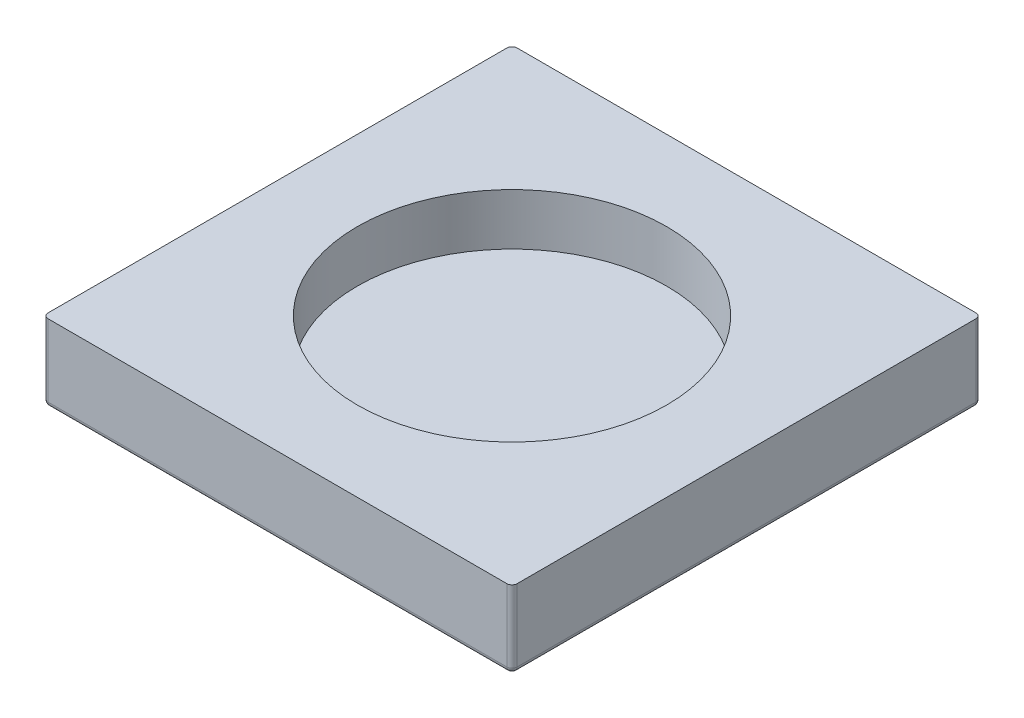
ISO-10303-21;
HEADER;
FILE_DESCRIPTION(('STEP AP214'),'2;1');
FILE_NAME('part.step','',(''),(''),'','','');
FILE_SCHEMA(('AUTOMOTIVE_DESIGN { 1 0 10303 214 1 1 1 1 }'));
ENDSEC;
DATA;
#1=APPLICATION_CONTEXT('core data for automotive mechanical design processes');
#2=APPLICATION_PROTOCOL_DEFINITION('international standard','automotive_design',2000,#1);
#3=PRODUCT_CONTEXT('',#1,'mechanical');
#4=PRODUCT('Part','Part','',(#3));
#5=PRODUCT_RELATED_PRODUCT_CATEGORY('part','',(#4));
#6=PRODUCT_DEFINITION_FORMATION('','',#4);
#7=PRODUCT_DEFINITION_CONTEXT('part definition',#1,'design');
#8=PRODUCT_DEFINITION('design','',#6,#7);
#9=PRODUCT_DEFINITION_SHAPE('','',#8);
#10=(LENGTH_UNIT() NAMED_UNIT(*) SI_UNIT(.MILLI.,.METRE.));
#11=(NAMED_UNIT(*) PLANE_ANGLE_UNIT() SI_UNIT($,.RADIAN.));
#12=(NAMED_UNIT(*) SI_UNIT($,.STERADIAN.) SOLID_ANGLE_UNIT());
#13=UNCERTAINTY_MEASURE_WITH_UNIT(LENGTH_MEASURE(1.E-05),#10,'distance_accuracy_value','');
#14=(GEOMETRIC_REPRESENTATION_CONTEXT(3) GLOBAL_UNCERTAINTY_ASSIGNED_CONTEXT((#13)) GLOBAL_UNIT_ASSIGNED_CONTEXT((#10,
#11,#12)) REPRESENTATION_CONTEXT('',''));
#15=CARTESIAN_POINT('',(0.,0.,0.));
#16=DIRECTION('',(0.,0.,1.));
#17=DIRECTION('',(1.,0.,0.));
#18=AXIS2_PLACEMENT_3D('',#15,#16,#17);
#19=CARTESIAN_POINT('',(22.75,7.5,22.75));
#20=DIRECTION('',(-1.,0.,0.));
#21=DIRECTION('',(0.,0.,1.));
#22=AXIS2_PLACEMENT_3D('',#19,#20,#21);
#23=PLANE('',#22);
#24=DIRECTION('',(0.,0.,-1.));
#25=VECTOR('',#24,1.);
#26=CARTESIAN_POINT('',(22.75,0.5,-22.75));
#27=LINE('',#26,#25);
#28=CARTESIAN_POINT('',(22.75,0.5,22.25));
#29=VERTEX_POINT('',#28);
#30=CARTESIAN_POINT('',(22.75,0.5,-22.25));
#31=VERTEX_POINT('',#30);
#32=EDGE_CURVE('E155',#29,#31,#27,.T.);
#33=ORIENTED_EDGE('',*,*,#32,.T.);
#34=DIRECTION('',(0.,-1.,0.));
#35=VECTOR('',#34,1.);
#36=CARTESIAN_POINT('',(22.75,7.5,-22.25));
#37=LINE('',#36,#35);
#38=CARTESIAN_POINT('',(22.75,7.5,-22.25));
#39=VERTEX_POINT('',#38);
#40=EDGE_CURVE('E157',#31,#39,#37,.F.);
#41=ORIENTED_EDGE('',*,*,#40,.T.);
#42=DIRECTION('',(0.,0.,-1.));
#43=VECTOR('',#42,1.);
#44=CARTESIAN_POINT('',(22.75,7.5,22.75));
#45=LINE('',#44,#43);
#46=CARTESIAN_POINT('',(22.75,7.5,22.25));
#47=VERTEX_POINT('',#46);
#48=EDGE_CURVE('E203',#47,#39,#45,.T.);
#49=ORIENTED_EDGE('',*,*,#48,.F.);
#50=DIRECTION('',(0.,-1.,0.));
#51=VECTOR('',#50,1.);
#52=CARTESIAN_POINT('',(22.75,7.5,22.25));
#53=LINE('',#52,#51);
#54=EDGE_CURVE('E123',#47,#29,#53,.T.);
#55=ORIENTED_EDGE('',*,*,#54,.T.);
#56=EDGE_LOOP('',(#33,#41,#49,#55));
#57=FACE_BOUND('',#56,.T.);
#58=ADVANCED_FACE('F37',(#57),#23,.F.);
#59=CARTESIAN_POINT('',(-22.75,7.5,-22.75));
#60=DIRECTION('',(0.,0.,1.));
#61=DIRECTION('',(1.,0.,0.));
#62=AXIS2_PLACEMENT_3D('',#59,#60,#61);
#63=PLANE('',#62);
#64=DIRECTION('',(-1.,0.,0.));
#65=VECTOR('',#64,1.);
#66=CARTESIAN_POINT('',(-22.75,0.5,-22.75));
#67=LINE('',#66,#65);
#68=CARTESIAN_POINT('',(22.25,0.5,-22.75));
#69=VERTEX_POINT('',#68);
#70=CARTESIAN_POINT('',(-22.25,0.5,-22.75));
#71=VERTEX_POINT('',#70);
#72=EDGE_CURVE('E138',#69,#71,#67,.T.);
#73=ORIENTED_EDGE('',*,*,#72,.T.);
#74=DIRECTION('',(0.,-1.,0.));
#75=VECTOR('',#74,1.);
#76=CARTESIAN_POINT('',(-22.25,7.5,-22.75));
#77=LINE('',#76,#75);
#78=CARTESIAN_POINT('',(-22.25,7.5,-22.75));
#79=VERTEX_POINT('',#78);
#80=EDGE_CURVE('E147',#71,#79,#77,.F.);
#81=ORIENTED_EDGE('',*,*,#80,.T.);
#82=DIRECTION('',(-1.,0.,0.));
#83=VECTOR('',#82,1.);
#84=CARTESIAN_POINT('',(-22.75,7.5,-22.75));
#85=LINE('',#84,#83);
#86=CARTESIAN_POINT('',(22.25,7.5,-22.75));
#87=VERTEX_POINT('',#86);
#88=EDGE_CURVE('E119',#87,#79,#85,.T.);
#89=ORIENTED_EDGE('',*,*,#88,.F.);
#90=DIRECTION('',(0.,-1.,0.));
#91=VECTOR('',#90,1.);
#92=CARTESIAN_POINT('',(22.25,7.5,-22.75));
#93=LINE('',#92,#91);
#94=EDGE_CURVE('E141',#87,#69,#93,.T.);
#95=ORIENTED_EDGE('',*,*,#94,.T.);
#96=EDGE_LOOP('',(#73,#81,#89,#95));
#97=FACE_BOUND('',#96,.T.);
#98=ADVANCED_FACE('F240',(#97),#63,.F.);
#99=CARTESIAN_POINT('',(-22.75,7.5,22.75));
#100=DIRECTION('',(1.,0.,0.));
#101=DIRECTION('',(0.,0.,-1.));
#102=AXIS2_PLACEMENT_3D('',#99,#100,#101);
#103=PLANE('',#102);
#104=DIRECTION('',(0.,0.,1.));
#105=VECTOR('',#104,1.);
#106=CARTESIAN_POINT('',(-22.75,7.5,22.75));
#107=LINE('',#106,#105);
#108=CARTESIAN_POINT('',(-22.75,7.5,-22.25));
#109=VERTEX_POINT('',#108);
#110=CARTESIAN_POINT('',(-22.75,7.5,22.25));
#111=VERTEX_POINT('',#110);
#112=EDGE_CURVE('E116',#109,#111,#107,.T.);
#113=ORIENTED_EDGE('',*,*,#112,.F.);
#114=DIRECTION('',(0.,-1.,0.));
#115=VECTOR('',#114,1.);
#116=CARTESIAN_POINT('',(-22.75,7.5,-22.25));
#117=LINE('',#116,#115);
#118=CARTESIAN_POINT('',(-22.75,0.5,-22.25));
#119=VERTEX_POINT('',#118);
#120=EDGE_CURVE('E129',#109,#119,#117,.T.);
#121=ORIENTED_EDGE('',*,*,#120,.T.);
#122=DIRECTION('',(0.,0.,1.));
#123=VECTOR('',#122,1.);
#124=CARTESIAN_POINT('',(-22.75,0.5,22.75));
#125=LINE('',#124,#123);
#126=CARTESIAN_POINT('',(-22.75,0.5,22.25));
#127=VERTEX_POINT('',#126);
#128=EDGE_CURVE('E139',#119,#127,#125,.T.);
#129=ORIENTED_EDGE('',*,*,#128,.T.);
#130=DIRECTION('',(0.,-1.,0.));
#131=VECTOR('',#130,1.);
#132=CARTESIAN_POINT('',(-22.75,7.5,22.25));
#133=LINE('',#132,#131);
#134=EDGE_CURVE('E131',#127,#111,#133,.F.);
#135=ORIENTED_EDGE('',*,*,#134,.T.);
#136=EDGE_LOOP('',(#113,#121,#129,#135));
#137=FACE_BOUND('',#136,.T.);
#138=ADVANCED_FACE('F128',(#137),#103,.F.);
#139=CARTESIAN_POINT('',(-22.75,7.5,22.75));
#140=DIRECTION('',(0.,0.,-1.));
#141=DIRECTION('',(-1.,0.,0.));
#142=AXIS2_PLACEMENT_3D('',#139,#140,#141);
#143=PLANE('',#142);
#144=DIRECTION('',(1.,0.,0.));
#145=VECTOR('',#144,1.);
#146=CARTESIAN_POINT('',(-22.75,7.5,22.75));
#147=LINE('',#146,#145);
#148=CARTESIAN_POINT('',(-22.25,7.5,22.75));
#149=VERTEX_POINT('',#148);
#150=CARTESIAN_POINT('',(22.25,7.5,22.75));
#151=VERTEX_POINT('',#150);
#152=EDGE_CURVE('E132',#149,#151,#147,.T.);
#153=ORIENTED_EDGE('',*,*,#152,.F.);
#154=DIRECTION('',(0.,-1.,0.));
#155=VECTOR('',#154,1.);
#156=CARTESIAN_POINT('',(-22.25,7.5,22.75));
#157=LINE('',#156,#155);
#158=CARTESIAN_POINT('',(-22.25,0.5,22.75));
#159=VERTEX_POINT('',#158);
#160=EDGE_CURVE('E11',#149,#159,#157,.T.);
#161=ORIENTED_EDGE('',*,*,#160,.T.);
#162=DIRECTION('',(1.,0.,0.));
#163=VECTOR('',#162,1.);
#164=CARTESIAN_POINT('',(22.75,0.5,22.75));
#165=LINE('',#164,#163);
#166=CARTESIAN_POINT('',(22.25,0.5,22.75));
#167=VERTEX_POINT('',#166);
#168=EDGE_CURVE('E46',#159,#167,#165,.T.);
#169=ORIENTED_EDGE('',*,*,#168,.T.);
#170=DIRECTION('',(0.,-1.,0.));
#171=VECTOR('',#170,1.);
#172=CARTESIAN_POINT('',(22.25,7.5,22.75));
#173=LINE('',#172,#171);
#174=EDGE_CURVE('E168',#167,#151,#173,.F.);
#175=ORIENTED_EDGE('',*,*,#174,.T.);
#176=EDGE_LOOP('',(#153,#161,#169,#175));
#177=FACE_BOUND('',#176,.T.);
#178=ADVANCED_FACE('F424',(#177),#143,.F.);
#179=CARTESIAN_POINT('',(0.,7.5,0.));
#180=DIRECTION('',(0.,-1.,0.));
#181=DIRECTION('',(0.,0.,-1.));
#182=AXIS2_PLACEMENT_3D('',#179,#180,#181);
#183=PLANE('',#182);
#184=CARTESIAN_POINT('',(0.,7.5,0.));
#185=DIRECTION('',(0.,1.,0.));
#186=DIRECTION('',(0.,0.,1.));
#187=AXIS2_PLACEMENT_3D('',#184,#185,#186);
#188=CIRCLE('',#187,15.);
#189=CARTESIAN_POINT('',(0.,7.5,15.));
#190=VERTEX_POINT('',#189);
#191=EDGE_CURVE('E213',#190,#190,#188,.T.);
#192=ORIENTED_EDGE('',*,*,#191,.F.);
#193=EDGE_LOOP('',(#192));
#194=FACE_BOUND('',#193,.T.);
#195=ORIENTED_EDGE('',*,*,#88,.T.);
#196=CARTESIAN_POINT('',(-22.25,7.5,-22.25));
#197=DIRECTION('',(0.,-1.,0.));
#198=DIRECTION('',(0.,0.,-1.));
#199=AXIS2_PLACEMENT_3D('',#196,#197,#198);
#200=CIRCLE('',#199,0.5);
#201=EDGE_CURVE('E113',#79,#109,#200,.F.);
#202=ORIENTED_EDGE('',*,*,#201,.T.);
#203=ORIENTED_EDGE('',*,*,#112,.T.);
#204=CARTESIAN_POINT('',(-22.25,7.5,22.25));
#205=DIRECTION('',(0.,-1.,0.));
#206=DIRECTION('',(0.,0.,-1.));
#207=AXIS2_PLACEMENT_3D('',#204,#205,#206);
#208=CIRCLE('',#207,0.5);
#209=EDGE_CURVE('E151',#111,#149,#208,.F.);
#210=ORIENTED_EDGE('',*,*,#209,.T.);
#211=ORIENTED_EDGE('',*,*,#152,.T.);
#212=CARTESIAN_POINT('',(22.25,7.5,22.25));
#213=DIRECTION('',(0.,-1.,0.));
#214=DIRECTION('',(0.,0.,-1.));
#215=AXIS2_PLACEMENT_3D('',#212,#213,#214);
#216=CIRCLE('',#215,0.5);
#217=EDGE_CURVE('E149',#151,#47,#216,.F.);
#218=ORIENTED_EDGE('',*,*,#217,.T.);
#219=ORIENTED_EDGE('',*,*,#48,.T.);
#220=CARTESIAN_POINT('',(22.25,7.5,-22.25));
#221=DIRECTION('',(0.,-1.,0.));
#222=DIRECTION('',(0.,0.,-1.));
#223=AXIS2_PLACEMENT_3D('',#220,#221,#222);
#224=CIRCLE('',#223,0.5);
#225=EDGE_CURVE('E124',#39,#87,#224,.F.);
#226=ORIENTED_EDGE('',*,*,#225,.T.);
#227=EDGE_LOOP('',(#195,#202,#203,#210,#211,#218,#219,#226));
#228=FACE_BOUND('',#227,.T.);
#229=ADVANCED_FACE('F115',(#194,#228),#183,.F.);
#230=CARTESIAN_POINT('',(0.,0.,0.));
#231=DIRECTION('',(0.,-1.,0.));
#232=DIRECTION('',(0.,0.,-1.));
#233=AXIS2_PLACEMENT_3D('',#230,#231,#232);
#234=PLANE('',#233);
#235=DIRECTION('',(1.,0.,0.));
#236=VECTOR('',#235,1.);
#237=CARTESIAN_POINT('',(-22.75,0.,22.25));
#238=LINE('',#237,#236);
#239=CARTESIAN_POINT('',(22.25,0.,22.25));
#240=VERTEX_POINT('',#239);
#241=CARTESIAN_POINT('',(-22.25,0.,22.25));
#242=VERTEX_POINT('',#241);
#243=EDGE_CURVE('E159',#240,#242,#238,.F.);
#244=ORIENTED_EDGE('',*,*,#243,.T.);
#245=DIRECTION('',(0.,0.,1.));
#246=VECTOR('',#245,1.);
#247=CARTESIAN_POINT('',(-22.25,0.,-22.75));
#248=LINE('',#247,#246);
#249=CARTESIAN_POINT('',(-22.25,0.,-22.25));
#250=VERTEX_POINT('',#249);
#251=EDGE_CURVE('E165',#242,#250,#248,.F.);
#252=ORIENTED_EDGE('',*,*,#251,.T.);
#253=DIRECTION('',(-1.,0.,0.));
#254=VECTOR('',#253,1.);
#255=CARTESIAN_POINT('',(22.75,0.,-22.25));
#256=LINE('',#255,#254);
#257=CARTESIAN_POINT('',(22.25,0.,-22.25));
#258=VERTEX_POINT('',#257);
#259=EDGE_CURVE('E163',#250,#258,#256,.F.);
#260=ORIENTED_EDGE('',*,*,#259,.T.);
#261=DIRECTION('',(0.,0.,-1.));
#262=VECTOR('',#261,1.);
#263=CARTESIAN_POINT('',(22.25,0.,22.75));
#264=LINE('',#263,#262);
#265=EDGE_CURVE('E161',#258,#240,#264,.F.);
#266=ORIENTED_EDGE('',*,*,#265,.T.);
#267=EDGE_LOOP('',(#244,#252,#260,#266));
#268=FACE_BOUND('',#267,.T.);
#269=ADVANCED_FACE('F257',(#268),#234,.T.);
#270=CARTESIAN_POINT('',(22.25,7.5,22.25));
#271=DIRECTION('',(0.,-1.,0.));
#272=DIRECTION('',(0.,0.,-1.));
#273=AXIS2_PLACEMENT_3D('',#270,#271,#272);
#274=CYLINDRICAL_SURFACE('',#273,0.5);
#275=CARTESIAN_POINT('',(22.25,0.5,22.25));
#276=DIRECTION('',(0.,-1.,0.));
#277=DIRECTION('',(0.,0.,-1.));
#278=AXIS2_PLACEMENT_3D('',#275,#276,#277);
#279=CIRCLE('',#278,0.5);
#280=EDGE_CURVE('E41',#29,#167,#279,.T.);
#281=ORIENTED_EDGE('',*,*,#280,.F.);
#282=ORIENTED_EDGE('',*,*,#54,.F.);
#283=ORIENTED_EDGE('',*,*,#217,.F.);
#284=ORIENTED_EDGE('',*,*,#174,.F.);
#285=EDGE_LOOP('',(#281,#282,#283,#284));
#286=FACE_BOUND('',#285,.T.);
#287=ADVANCED_FACE('F39',(#286),#274,.T.);
#288=CARTESIAN_POINT('',(22.25,0.5,22.25));
#289=DIRECTION('',(0.,0.,1.));
#290=DIRECTION('',(0.,-1.,0.));
#291=AXIS2_PLACEMENT_3D('',#288,#289,#290);
#292=SPHERICAL_SURFACE('',#291,0.5);
#293=CARTESIAN_POINT('',(22.25,0.5,22.25));
#294=DIRECTION('',(0.,0.,1.));
#295=DIRECTION('',(1.,0.,0.));
#296=AXIS2_PLACEMENT_3D('',#293,#294,#295);
#297=CIRCLE('',#296,0.5);
#298=EDGE_CURVE('E195',#29,#240,#297,.F.);
#299=ORIENTED_EDGE('',*,*,#298,.F.);
#300=ORIENTED_EDGE('',*,*,#280,.T.);
#301=CARTESIAN_POINT('',(22.25,0.5,22.25));
#302=DIRECTION('',(1.,0.,0.));
#303=DIRECTION('',(0.,0.,-1.));
#304=AXIS2_PLACEMENT_3D('',#301,#302,#303);
#305=CIRCLE('',#304,0.5);
#306=EDGE_CURVE('E197',#240,#167,#305,.F.);
#307=ORIENTED_EDGE('',*,*,#306,.F.);
#308=EDGE_LOOP('',(#299,#300,#307));
#309=FACE_BOUND('',#308,.T.);
#310=ADVANCED_FACE('F258',(#309),#292,.T.);
#311=CARTESIAN_POINT('',(-22.25,7.5,22.25));
#312=DIRECTION('',(0.,-1.,0.));
#313=DIRECTION('',(0.,0.,-1.));
#314=AXIS2_PLACEMENT_3D('',#311,#312,#313);
#315=CYLINDRICAL_SURFACE('',#314,0.5);
#316=ORIENTED_EDGE('',*,*,#209,.F.);
#317=ORIENTED_EDGE('',*,*,#134,.F.);
#318=CARTESIAN_POINT('',(-22.25,0.5,22.25));
#319=DIRECTION('',(0.,-1.,0.));
#320=DIRECTION('',(0.,0.,-1.));
#321=AXIS2_PLACEMENT_3D('',#318,#319,#320);
#322=CIRCLE('',#321,0.5);
#323=EDGE_CURVE('E192',#159,#127,#322,.T.);
#324=ORIENTED_EDGE('',*,*,#323,.F.);
#325=ORIENTED_EDGE('',*,*,#160,.F.);
#326=EDGE_LOOP('',(#316,#317,#324,#325));
#327=FACE_BOUND('',#326,.T.);
#328=ADVANCED_FACE('F251',(#327),#315,.T.);
#329=CARTESIAN_POINT('',(-22.75,0.5,22.25));
#330=DIRECTION('',(-1.,0.,0.));
#331=DIRECTION('',(0.,0.,1.));
#332=AXIS2_PLACEMENT_3D('',#329,#330,#331);
#333=CYLINDRICAL_SURFACE('',#332,0.5);
#334=ORIENTED_EDGE('',*,*,#306,.T.);
#335=ORIENTED_EDGE('',*,*,#168,.F.);
#336=CARTESIAN_POINT('',(-22.25,0.5,22.25));
#337=DIRECTION('',(-1.,0.,0.));
#338=DIRECTION('',(0.,0.,1.));
#339=AXIS2_PLACEMENT_3D('',#336,#337,#338);
#340=CIRCLE('',#339,0.5);
#341=EDGE_CURVE('E189',#242,#159,#340,.T.);
#342=ORIENTED_EDGE('',*,*,#341,.F.);
#343=ORIENTED_EDGE('',*,*,#243,.F.);
#344=EDGE_LOOP('',(#334,#335,#342,#343));
#345=FACE_BOUND('',#344,.T.);
#346=ADVANCED_FACE('F255',(#345),#333,.T.);
#347=CARTESIAN_POINT('',(22.25,0.5,22.75));
#348=DIRECTION('',(0.,0.,1.));
#349=DIRECTION('',(1.,0.,0.));
#350=AXIS2_PLACEMENT_3D('',#347,#348,#349);
#351=CYLINDRICAL_SURFACE('',#350,0.5);
#352=ORIENTED_EDGE('',*,*,#298,.T.);
#353=ORIENTED_EDGE('',*,*,#265,.F.);
#354=CARTESIAN_POINT('',(22.25,0.5,-22.25));
#355=DIRECTION('',(0.,0.,-1.));
#356=DIRECTION('',(-1.,0.,0.));
#357=AXIS2_PLACEMENT_3D('',#354,#355,#356);
#358=CIRCLE('',#357,0.5);
#359=EDGE_CURVE('E186',#31,#258,#358,.T.);
#360=ORIENTED_EDGE('',*,*,#359,.F.);
#361=ORIENTED_EDGE('',*,*,#32,.F.);
#362=EDGE_LOOP('',(#352,#353,#360,#361));
#363=FACE_BOUND('',#362,.T.);
#364=ADVANCED_FACE('F231',(#363),#351,.T.);
#365=CARTESIAN_POINT('',(22.25,7.5,-22.25));
#366=DIRECTION('',(0.,-1.,0.));
#367=DIRECTION('',(0.,0.,-1.));
#368=AXIS2_PLACEMENT_3D('',#365,#366,#367);
#369=CYLINDRICAL_SURFACE('',#368,0.5);
#370=ORIENTED_EDGE('',*,*,#225,.F.);
#371=ORIENTED_EDGE('',*,*,#40,.F.);
#372=CARTESIAN_POINT('',(22.25,0.5,-22.25));
#373=DIRECTION('',(0.,-1.,0.));
#374=DIRECTION('',(0.,0.,-1.));
#375=AXIS2_PLACEMENT_3D('',#372,#373,#374);
#376=CIRCLE('',#375,0.5);
#377=EDGE_CURVE('E183',#69,#31,#376,.T.);
#378=ORIENTED_EDGE('',*,*,#377,.F.);
#379=ORIENTED_EDGE('',*,*,#94,.F.);
#380=EDGE_LOOP('',(#370,#371,#378,#379));
#381=FACE_BOUND('',#380,.T.);
#382=ADVANCED_FACE('F226',(#381),#369,.T.);
#383=CARTESIAN_POINT('',(-22.25,0.5,22.25));
#384=DIRECTION('',(0.,0.,1.));
#385=DIRECTION('',(0.,-1.,0.));
#386=AXIS2_PLACEMENT_3D('',#383,#384,#385);
#387=SPHERICAL_SURFACE('',#386,0.5);
#388=ORIENTED_EDGE('',*,*,#341,.T.);
#389=ORIENTED_EDGE('',*,*,#323,.T.);
#390=CARTESIAN_POINT('',(-22.25,0.5,22.25));
#391=DIRECTION('',(0.,0.,1.));
#392=DIRECTION('',(1.,0.,0.));
#393=AXIS2_PLACEMENT_3D('',#390,#391,#392);
#394=CIRCLE('',#393,0.5);
#395=EDGE_CURVE('E180',#242,#127,#394,.F.);
#396=ORIENTED_EDGE('',*,*,#395,.F.);
#397=EDGE_LOOP('',(#388,#389,#396));
#398=FACE_BOUND('',#397,.T.);
#399=ADVANCED_FACE('F253',(#398),#387,.T.);
#400=CARTESIAN_POINT('',(22.25,0.5,-22.25));
#401=DIRECTION('',(1.,0.,0.));
#402=DIRECTION('',(0.,1.,0.));
#403=AXIS2_PLACEMENT_3D('',#400,#401,#402);
#404=SPHERICAL_SURFACE('',#403,0.5);
#405=ORIENTED_EDGE('',*,*,#377,.T.);
#406=ORIENTED_EDGE('',*,*,#359,.T.);
#407=CARTESIAN_POINT('',(22.25,0.5,-22.25));
#408=DIRECTION('',(1.,0.,0.));
#409=DIRECTION('',(0.,0.,-1.));
#410=AXIS2_PLACEMENT_3D('',#407,#408,#409);
#411=CIRCLE('',#410,0.5);
#412=EDGE_CURVE('E177',#69,#258,#411,.F.);
#413=ORIENTED_EDGE('',*,*,#412,.F.);
#414=EDGE_LOOP('',(#405,#406,#413));
#415=FACE_BOUND('',#414,.T.);
#416=ADVANCED_FACE('F233',(#415),#404,.T.);
#417=CARTESIAN_POINT('',(-22.25,0.5,22.75));
#418=DIRECTION('',(0.,0.,-1.));
#419=DIRECTION('',(-1.,0.,0.));
#420=AXIS2_PLACEMENT_3D('',#417,#418,#419);
#421=CYLINDRICAL_SURFACE('',#420,0.5);
#422=ORIENTED_EDGE('',*,*,#395,.T.);
#423=ORIENTED_EDGE('',*,*,#128,.F.);
#424=CARTESIAN_POINT('',(-22.25,0.5,-22.25));
#425=DIRECTION('',(0.,0.,-1.));
#426=DIRECTION('',(-1.,0.,0.));
#427=AXIS2_PLACEMENT_3D('',#424,#425,#426);
#428=CIRCLE('',#427,0.5);
#429=EDGE_CURVE('E175',#250,#119,#428,.T.);
#430=ORIENTED_EDGE('',*,*,#429,.F.);
#431=ORIENTED_EDGE('',*,*,#251,.F.);
#432=EDGE_LOOP('',(#422,#423,#430,#431));
#433=FACE_BOUND('',#432,.T.);
#434=ADVANCED_FACE('F247',(#433),#421,.T.);
#435=CARTESIAN_POINT('',(-22.75,0.5,-22.25));
#436=DIRECTION('',(1.,0.,0.));
#437=DIRECTION('',(0.,0.,-1.));
#438=AXIS2_PLACEMENT_3D('',#435,#436,#437);
#439=CYLINDRICAL_SURFACE('',#438,0.5);
#440=ORIENTED_EDGE('',*,*,#412,.T.);
#441=ORIENTED_EDGE('',*,*,#259,.F.);
#442=CARTESIAN_POINT('',(-22.25,0.5,-22.25));
#443=DIRECTION('',(-1.,0.,0.));
#444=DIRECTION('',(0.,0.,1.));
#445=AXIS2_PLACEMENT_3D('',#442,#443,#444);
#446=CIRCLE('',#445,0.5);
#447=EDGE_CURVE('E172',#71,#250,#446,.T.);
#448=ORIENTED_EDGE('',*,*,#447,.F.);
#449=ORIENTED_EDGE('',*,*,#72,.F.);
#450=EDGE_LOOP('',(#440,#441,#448,#449));
#451=FACE_BOUND('',#450,.T.);
#452=ADVANCED_FACE('F238',(#451),#439,.T.);
#453=CARTESIAN_POINT('',(-22.25,0.5,-22.25));
#454=DIRECTION('',(0.,-1.,0.));
#455=DIRECTION('',(0.,0.,-1.));
#456=AXIS2_PLACEMENT_3D('',#453,#454,#455);
#457=SPHERICAL_SURFACE('',#456,0.5);
#458=ORIENTED_EDGE('',*,*,#447,.T.);
#459=ORIENTED_EDGE('',*,*,#429,.T.);
#460=CARTESIAN_POINT('',(-22.25,0.5,-22.25));
#461=DIRECTION('',(0.,-1.,0.));
#462=DIRECTION('',(0.,0.,-1.));
#463=AXIS2_PLACEMENT_3D('',#460,#461,#462);
#464=CIRCLE('',#463,0.5);
#465=EDGE_CURVE('E136',#71,#119,#464,.F.);
#466=ORIENTED_EDGE('',*,*,#465,.F.);
#467=EDGE_LOOP('',(#458,#459,#466));
#468=FACE_BOUND('',#467,.T.);
#469=ADVANCED_FACE('F242',(#468),#457,.T.);
#470=CARTESIAN_POINT('',(-22.25,7.5,-22.25));
#471=DIRECTION('',(0.,-1.,0.));
#472=DIRECTION('',(0.,0.,-1.));
#473=AXIS2_PLACEMENT_3D('',#470,#471,#472);
#474=CYLINDRICAL_SURFACE('',#473,0.5);
#475=ORIENTED_EDGE('',*,*,#201,.F.);
#476=ORIENTED_EDGE('',*,*,#80,.F.);
#477=ORIENTED_EDGE('',*,*,#465,.T.);
#478=ORIENTED_EDGE('',*,*,#120,.F.);
#479=EDGE_LOOP('',(#475,#476,#477,#478));
#480=FACE_BOUND('',#479,.T.);
#481=ADVANCED_FACE('F134',(#480),#474,.T.);
#482=CARTESIAN_POINT('',(0.,2.5,0.));
#483=DIRECTION('',(0.,1.,0.));
#484=DIRECTION('',(0.,0.,1.));
#485=AXIS2_PLACEMENT_3D('',#482,#483,#484);
#486=CYLINDRICAL_SURFACE('',#485,15.);
#487=CARTESIAN_POINT('',(0.,2.5,0.));
#488=DIRECTION('',(0.,1.,0.));
#489=DIRECTION('',(0.,0.,1.));
#490=AXIS2_PLACEMENT_3D('',#487,#488,#489);
#491=CIRCLE('',#490,15.);
#492=CARTESIAN_POINT('',(0.,2.5,15.));
#493=VERTEX_POINT('',#492);
#494=EDGE_CURVE('E173',#493,#493,#491,.T.);
#495=ORIENTED_EDGE('',*,*,#494,.F.);
#496=EDGE_LOOP('',(#495));
#497=FACE_BOUND('',#496,.T.);
#498=ORIENTED_EDGE('',*,*,#191,.T.);
#499=EDGE_LOOP('',(#498));
#500=FACE_BOUND('',#499,.T.);
#501=ADVANCED_FACE('F275',(#497,#500),#486,.F.);
#502=CARTESIAN_POINT('',(0.,2.5,0.));
#503=DIRECTION('',(0.,1.,0.));
#504=DIRECTION('',(0.,0.,1.));
#505=AXIS2_PLACEMENT_3D('',#502,#503,#504);
#506=PLANE('',#505);
#507=ORIENTED_EDGE('',*,*,#494,.T.);
#508=EDGE_LOOP('',(#507));
#509=FACE_BOUND('',#508,.T.);
#510=ADVANCED_FACE('F334',(#509),#506,.T.);
#511=CLOSED_SHELL('',(#58,#98,#138,#178,#229,#269,#287,#310,#328,#346,#364,#382,#399,#416,#434,
#452,#469,#481,#501,#510));
#512=MANIFOLD_SOLID_BREP('B2',#511);
#513=ADVANCED_BREP_SHAPE_REPRESENTATION('',(#18,#512),#14);
#514=SHAPE_DEFINITION_REPRESENTATION(#9,#513);
ENDSEC;
END-ISO-10303-21;
